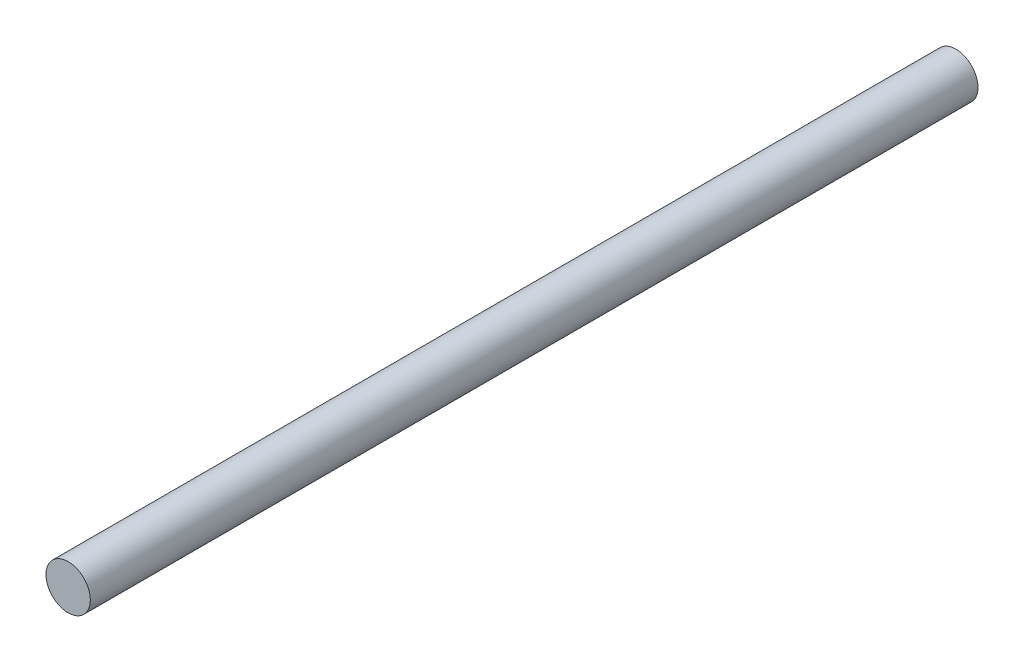
ISO-10303-21;
HEADER;
FILE_DESCRIPTION(('STEP AP214'),'2;1');
FILE_NAME('part.step','',(''),(''),'','','');
FILE_SCHEMA(('AUTOMOTIVE_DESIGN { 1 0 10303 214 1 1 1 1 }'));
ENDSEC;
DATA;
#1=APPLICATION_CONTEXT('core data for automotive mechanical design processes');
#2=APPLICATION_PROTOCOL_DEFINITION('international standard','automotive_design',2000,#1);
#3=PRODUCT_CONTEXT('',#1,'mechanical');
#4=PRODUCT('Part','Part','',(#3));
#5=PRODUCT_RELATED_PRODUCT_CATEGORY('part','',(#4));
#6=PRODUCT_DEFINITION_FORMATION('','',#4);
#7=PRODUCT_DEFINITION_CONTEXT('part definition',#1,'design');
#8=PRODUCT_DEFINITION('design','',#6,#7);
#9=PRODUCT_DEFINITION_SHAPE('','',#8);
#10=(LENGTH_UNIT() NAMED_UNIT(*) SI_UNIT(.MILLI.,.METRE.));
#11=(NAMED_UNIT(*) PLANE_ANGLE_UNIT() SI_UNIT($,.RADIAN.));
#12=(NAMED_UNIT(*) SI_UNIT($,.STERADIAN.) SOLID_ANGLE_UNIT());
#13=UNCERTAINTY_MEASURE_WITH_UNIT(LENGTH_MEASURE(1.E-05),#10,'distance_accuracy_value','');
#14=(GEOMETRIC_REPRESENTATION_CONTEXT(3) GLOBAL_UNCERTAINTY_ASSIGNED_CONTEXT((#13)) GLOBAL_UNIT_ASSIGNED_CONTEXT((#10,
#11,#12)) REPRESENTATION_CONTEXT('',''));
#15=CARTESIAN_POINT('',(0.,0.,0.));
#16=DIRECTION('',(0.,0.,1.));
#17=DIRECTION('',(1.,0.,0.));
#18=AXIS2_PLACEMENT_3D('',#15,#16,#17);
#19=CARTESIAN_POINT('',(0.,0.,-40.));
#20=DIRECTION('',(0.,0.,1.));
#21=DIRECTION('',(1.,0.,0.));
#22=AXIS2_PLACEMENT_3D('',#19,#20,#21);
#23=CYLINDRICAL_SURFACE('',#22,1.);
#24=CARTESIAN_POINT('',(0.,0.,-40.));
#25=DIRECTION('',(0.,0.,1.));
#26=DIRECTION('',(1.,0.,0.));
#27=AXIS2_PLACEMENT_3D('',#24,#25,#26);
#28=CIRCLE('',#27,1.);
#29=CARTESIAN_POINT('',(1.,0.,-40.));
#30=VERTEX_POINT('',#29);
#31=EDGE_CURVE('E10',#30,#30,#28,.T.);
#32=ORIENTED_EDGE('',*,*,#31,.T.);
#33=EDGE_LOOP('',(#32));
#34=FACE_BOUND('',#33,.T.);
#35=CARTESIAN_POINT('',(0.,0.,0.));
#36=DIRECTION('',(0.,0.,1.));
#37=DIRECTION('',(1.,0.,0.));
#38=AXIS2_PLACEMENT_3D('',#35,#36,#37);
#39=CIRCLE('',#38,1.);
#40=CARTESIAN_POINT('',(1.,0.,0.));
#41=VERTEX_POINT('',#40);
#42=EDGE_CURVE('E34',#41,#41,#39,.T.);
#43=ORIENTED_EDGE('',*,*,#42,.F.);
#44=EDGE_LOOP('',(#43));
#45=FACE_BOUND('',#44,.T.);
#46=ADVANCED_FACE('F31',(#34,#45),#23,.T.);
#47=CARTESIAN_POINT('',(0.,0.,-40.));
#48=DIRECTION('',(0.,0.,1.));
#49=DIRECTION('',(1.,0.,0.));
#50=AXIS2_PLACEMENT_3D('',#47,#48,#49);
#51=PLANE('',#50);
#52=ORIENTED_EDGE('',*,*,#31,.F.);
#53=EDGE_LOOP('',(#52));
#54=FACE_BOUND('',#53,.T.);
#55=ADVANCED_FACE('F46',(#54),#51,.F.);
#56=CARTESIAN_POINT('',(0.,0.,0.));
#57=DIRECTION('',(0.,0.,1.));
#58=DIRECTION('',(1.,0.,0.));
#59=AXIS2_PLACEMENT_3D('',#56,#57,#58);
#60=PLANE('',#59);
#61=ORIENTED_EDGE('',*,*,#42,.T.);
#62=EDGE_LOOP('',(#61));
#63=FACE_BOUND('',#62,.T.);
#64=ADVANCED_FACE('F43',(#63),#60,.T.);
#65=CLOSED_SHELL('',(#46,#55,#64));
#66=MANIFOLD_SOLID_BREP('B2',#65);
#67=ADVANCED_BREP_SHAPE_REPRESENTATION('',(#18,#66),#14);
#68=SHAPE_DEFINITION_REPRESENTATION(#9,#67);
ENDSEC;
END-ISO-10303-21;
